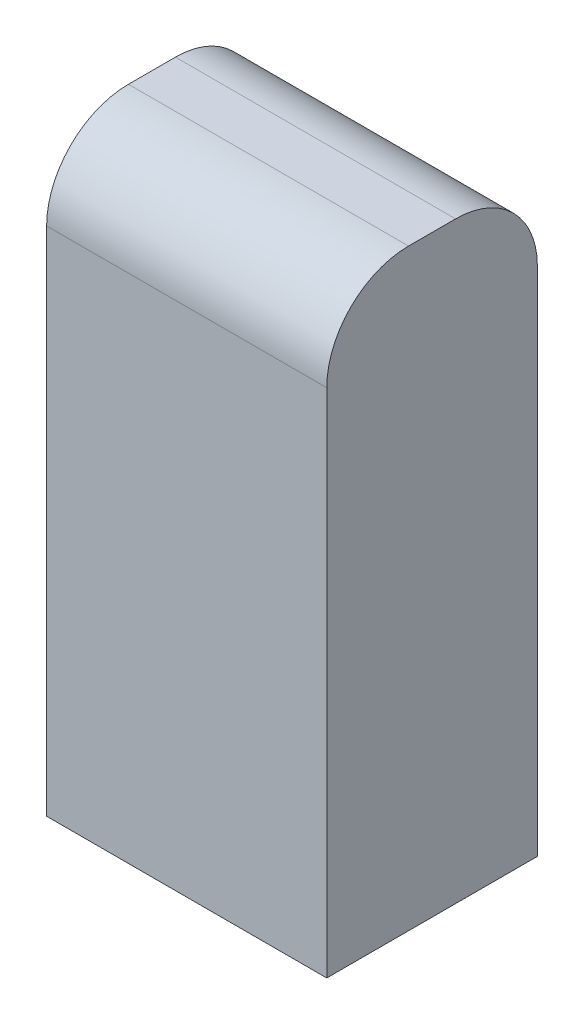
ISO-10303-21;
HEADER;
FILE_DESCRIPTION(('STEP AP214'),'2;1');
FILE_NAME('part.step','',(''),(''),'','','');
FILE_SCHEMA(('AUTOMOTIVE_DESIGN { 1 0 10303 214 1 1 1 1 }'));
ENDSEC;
DATA;
#1=APPLICATION_CONTEXT('core data for automotive mechanical design processes');
#2=APPLICATION_PROTOCOL_DEFINITION('international standard','automotive_design',2000,#1);
#3=PRODUCT_CONTEXT('',#1,'mechanical');
#4=PRODUCT('Part','Part','',(#3));
#5=PRODUCT_RELATED_PRODUCT_CATEGORY('part','',(#4));
#6=PRODUCT_DEFINITION_FORMATION('','',#4);
#7=PRODUCT_DEFINITION_CONTEXT('part definition',#1,'design');
#8=PRODUCT_DEFINITION('design','',#6,#7);
#9=PRODUCT_DEFINITION_SHAPE('','',#8);
#10=(LENGTH_UNIT() NAMED_UNIT(*) SI_UNIT(.MILLI.,.METRE.));
#11=(NAMED_UNIT(*) PLANE_ANGLE_UNIT() SI_UNIT($,.RADIAN.));
#12=(NAMED_UNIT(*) SI_UNIT($,.STERADIAN.) SOLID_ANGLE_UNIT());
#13=UNCERTAINTY_MEASURE_WITH_UNIT(LENGTH_MEASURE(1.E-05),#10,'distance_accuracy_value','');
#14=(GEOMETRIC_REPRESENTATION_CONTEXT(3) GLOBAL_UNCERTAINTY_ASSIGNED_CONTEXT((#13)) GLOBAL_UNIT_ASSIGNED_CONTEXT((#10,
#11,#12)) REPRESENTATION_CONTEXT('',''));
#15=CARTESIAN_POINT('',(0.,0.,0.));
#16=DIRECTION('',(0.,0.,1.));
#17=DIRECTION('',(1.,0.,0.));
#18=AXIS2_PLACEMENT_3D('',#15,#16,#17);
#19=CARTESIAN_POINT('',(17.399,73.66,13.081));
#20=DIRECTION('',(-1.,0.,0.));
#21=DIRECTION('',(0.,0.,1.));
#22=AXIS2_PLACEMENT_3D('',#19,#20,#21);
#23=PLANE('',#22);
#24=DIRECTION('',(0.,-1.,0.));
#25=VECTOR('',#24,1.);
#26=CARTESIAN_POINT('',(17.399,73.66,-13.081));
#27=LINE('',#26,#25);
#28=CARTESIAN_POINT('',(17.399,63.5,-13.081));
#29=VERTEX_POINT('',#28);
#30=CARTESIAN_POINT('',(17.399,0.,-13.081));
#31=VERTEX_POINT('',#30);
#32=EDGE_CURVE('E87',#29,#31,#27,.T.);
#33=ORIENTED_EDGE('',*,*,#32,.F.);
#34=CARTESIAN_POINT('',(17.399,63.5,-2.921));
#35=DIRECTION('',(-1.,0.,0.));
#36=DIRECTION('',(0.,0.,1.));
#37=AXIS2_PLACEMENT_3D('',#34,#35,#36);
#38=CIRCLE('',#37,10.16);
#39=CARTESIAN_POINT('',(17.399,73.66,-2.921));
#40=VERTEX_POINT('',#39);
#41=EDGE_CURVE('E44',#29,#40,#38,.F.);
#42=ORIENTED_EDGE('',*,*,#41,.T.);
#43=DIRECTION('',(0.,0.,-1.));
#44=VECTOR('',#43,1.);
#45=CARTESIAN_POINT('',(17.399,73.66,13.081));
#46=LINE('',#45,#44);
#47=CARTESIAN_POINT('',(17.399,73.66,2.921));
#48=VERTEX_POINT('',#47);
#49=EDGE_CURVE('E115',#48,#40,#46,.T.);
#50=ORIENTED_EDGE('',*,*,#49,.F.);
#51=CARTESIAN_POINT('',(17.399,63.5,2.921));
#52=DIRECTION('',(-1.,0.,0.));
#53=DIRECTION('',(0.,0.,1.));
#54=AXIS2_PLACEMENT_3D('',#51,#52,#53);
#55=CIRCLE('',#54,10.16);
#56=CARTESIAN_POINT('',(17.399,63.5,13.081));
#57=VERTEX_POINT('',#56);
#58=EDGE_CURVE('E51',#48,#57,#55,.F.);
#59=ORIENTED_EDGE('',*,*,#58,.T.);
#60=DIRECTION('',(0.,-1.,0.));
#61=VECTOR('',#60,1.);
#62=CARTESIAN_POINT('',(17.399,73.66,13.081));
#63=LINE('',#62,#61);
#64=CARTESIAN_POINT('',(17.399,0.,13.081));
#65=VERTEX_POINT('',#64);
#66=EDGE_CURVE('E105',#57,#65,#63,.T.);
#67=ORIENTED_EDGE('',*,*,#66,.T.);
#68=DIRECTION('',(0.,0.,-1.));
#69=VECTOR('',#68,1.);
#70=CARTESIAN_POINT('',(17.399,0.,13.081));
#71=LINE('',#70,#69);
#72=EDGE_CURVE('E101',#65,#31,#71,.T.);
#73=ORIENTED_EDGE('',*,*,#72,.T.);
#74=EDGE_LOOP('',(#33,#42,#50,#59,#67,#73));
#75=FACE_BOUND('',#74,.T.);
#76=ADVANCED_FACE('F36',(#75),#23,.F.);
#77=CARTESIAN_POINT('',(-17.399,73.66,-13.081));
#78=DIRECTION('',(0.,0.,1.));
#79=DIRECTION('',(1.,0.,0.));
#80=AXIS2_PLACEMENT_3D('',#77,#78,#79);
#81=PLANE('',#80);
#82=DIRECTION('',(0.,-1.,0.));
#83=VECTOR('',#82,1.);
#84=CARTESIAN_POINT('',(-17.399,73.66,-13.081));
#85=LINE('',#84,#83);
#86=CARTESIAN_POINT('',(-17.399,63.5,-13.081));
#87=VERTEX_POINT('',#86);
#88=CARTESIAN_POINT('',(-17.399,0.,-13.081));
#89=VERTEX_POINT('',#88);
#90=EDGE_CURVE('E95',#87,#89,#85,.T.);
#91=ORIENTED_EDGE('',*,*,#90,.F.);
#92=DIRECTION('',(-1.,0.,0.));
#93=VECTOR('',#92,1.);
#94=CARTESIAN_POINT('',(-17.399,63.5,-13.081));
#95=LINE('',#94,#93);
#96=EDGE_CURVE('E59',#87,#29,#95,.F.);
#97=ORIENTED_EDGE('',*,*,#96,.T.);
#98=ORIENTED_EDGE('',*,*,#32,.T.);
#99=DIRECTION('',(-1.,0.,0.));
#100=VECTOR('',#99,1.);
#101=CARTESIAN_POINT('',(-17.399,0.,-13.081));
#102=LINE('',#101,#100);
#103=EDGE_CURVE('E90',#31,#89,#102,.T.);
#104=ORIENTED_EDGE('',*,*,#103,.T.);
#105=EDGE_LOOP('',(#91,#97,#98,#104));
#106=FACE_BOUND('',#105,.T.);
#107=ADVANCED_FACE('F89',(#106),#81,.F.);
#108=CARTESIAN_POINT('',(-17.399,73.66,13.081));
#109=DIRECTION('',(1.,0.,0.));
#110=DIRECTION('',(0.,0.,-1.));
#111=AXIS2_PLACEMENT_3D('',#108,#109,#110);
#112=PLANE('',#111);
#113=DIRECTION('',(0.,0.,1.));
#114=VECTOR('',#113,1.);
#115=CARTESIAN_POINT('',(-17.399,73.66,13.081));
#116=LINE('',#115,#114);
#117=CARTESIAN_POINT('',(-17.399,73.66,-2.921));
#118=VERTEX_POINT('',#117);
#119=CARTESIAN_POINT('',(-17.399,73.66,2.921));
#120=VERTEX_POINT('',#119);
#121=EDGE_CURVE('E109',#118,#120,#116,.T.);
#122=ORIENTED_EDGE('',*,*,#121,.F.);
#123=CARTESIAN_POINT('',(-17.399,63.5,-2.921));
#124=DIRECTION('',(1.,0.,0.));
#125=DIRECTION('',(0.,0.,-1.));
#126=AXIS2_PLACEMENT_3D('',#123,#124,#125);
#127=CIRCLE('',#126,10.16);
#128=EDGE_CURVE('E127',#118,#87,#127,.F.);
#129=ORIENTED_EDGE('',*,*,#128,.T.);
#130=ORIENTED_EDGE('',*,*,#90,.T.);
#131=DIRECTION('',(0.,0.,1.));
#132=VECTOR('',#131,1.);
#133=CARTESIAN_POINT('',(-17.399,0.,13.081));
#134=LINE('',#133,#132);
#135=CARTESIAN_POINT('',(-17.399,0.,13.081));
#136=VERTEX_POINT('',#135);
#137=EDGE_CURVE('E103',#89,#136,#134,.T.);
#138=ORIENTED_EDGE('',*,*,#137,.T.);
#139=DIRECTION('',(0.,-1.,0.));
#140=VECTOR('',#139,1.);
#141=CARTESIAN_POINT('',(-17.399,73.66,13.081));
#142=LINE('',#141,#140);
#143=CARTESIAN_POINT('',(-17.399,63.5,13.081));
#144=VERTEX_POINT('',#143);
#145=EDGE_CURVE('E117',#144,#136,#142,.T.);
#146=ORIENTED_EDGE('',*,*,#145,.F.);
#147=CARTESIAN_POINT('',(-17.399,63.5,2.921));
#148=DIRECTION('',(1.,0.,0.));
#149=DIRECTION('',(0.,0.,-1.));
#150=AXIS2_PLACEMENT_3D('',#147,#148,#149);
#151=CIRCLE('',#150,10.16);
#152=EDGE_CURVE('E125',#144,#120,#151,.F.);
#153=ORIENTED_EDGE('',*,*,#152,.T.);
#154=EDGE_LOOP('',(#122,#129,#130,#138,#146,#153));
#155=FACE_BOUND('',#154,.T.);
#156=ADVANCED_FACE('F140',(#155),#112,.F.);
#157=CARTESIAN_POINT('',(-17.399,73.66,13.081));
#158=DIRECTION('',(0.,0.,-1.));
#159=DIRECTION('',(-1.,0.,0.));
#160=AXIS2_PLACEMENT_3D('',#157,#158,#159);
#161=PLANE('',#160);
#162=ORIENTED_EDGE('',*,*,#66,.F.);
#163=DIRECTION('',(1.,0.,0.));
#164=VECTOR('',#163,1.);
#165=CARTESIAN_POINT('',(-17.399,63.5,13.081));
#166=LINE('',#165,#164);
#167=EDGE_CURVE('E11',#57,#144,#166,.F.);
#168=ORIENTED_EDGE('',*,*,#167,.T.);
#169=ORIENTED_EDGE('',*,*,#145,.T.);
#170=DIRECTION('',(1.,0.,0.));
#171=VECTOR('',#170,1.);
#172=CARTESIAN_POINT('',(-17.399,0.,13.081));
#173=LINE('',#172,#171);
#174=EDGE_CURVE('E113',#136,#65,#173,.T.);
#175=ORIENTED_EDGE('',*,*,#174,.T.);
#176=EDGE_LOOP('',(#162,#168,#169,#175));
#177=FACE_BOUND('',#176,.T.);
#178=ADVANCED_FACE('F146',(#177),#161,.F.);
#179=CARTESIAN_POINT('',(0.,73.66,0.));
#180=DIRECTION('',(0.,-1.,0.));
#181=DIRECTION('',(0.,0.,-1.));
#182=AXIS2_PLACEMENT_3D('',#179,#180,#181);
#183=PLANE('',#182);
#184=ORIENTED_EDGE('',*,*,#49,.T.);
#185=DIRECTION('',(-1.,0.,0.));
#186=VECTOR('',#185,1.);
#187=CARTESIAN_POINT('',(0.,73.66,-2.921));
#188=LINE('',#187,#186);
#189=EDGE_CURVE('E122',#40,#118,#188,.T.);
#190=ORIENTED_EDGE('',*,*,#189,.T.);
#191=ORIENTED_EDGE('',*,*,#121,.T.);
#192=DIRECTION('',(1.,0.,0.));
#193=VECTOR('',#192,1.);
#194=CARTESIAN_POINT('',(0.,73.66,2.921));
#195=LINE('',#194,#193);
#196=EDGE_CURVE('E94',#120,#48,#195,.T.);
#197=ORIENTED_EDGE('',*,*,#196,.T.);
#198=EDGE_LOOP('',(#184,#190,#191,#197));
#199=FACE_BOUND('',#198,.T.);
#200=ADVANCED_FACE('F134',(#199),#183,.F.);
#201=CARTESIAN_POINT('',(0.,0.,0.));
#202=DIRECTION('',(0.,-1.,0.));
#203=DIRECTION('',(0.,0.,-1.));
#204=AXIS2_PLACEMENT_3D('',#201,#202,#203);
#205=PLANE('',#204);
#206=ORIENTED_EDGE('',*,*,#72,.F.);
#207=ORIENTED_EDGE('',*,*,#174,.F.);
#208=ORIENTED_EDGE('',*,*,#137,.F.);
#209=ORIENTED_EDGE('',*,*,#103,.F.);
#210=EDGE_LOOP('',(#206,#207,#208,#209));
#211=FACE_BOUND('',#210,.T.);
#212=ADVANCED_FACE('F99',(#211),#205,.T.);
#213=CARTESIAN_POINT('',(0.,63.5,-2.921));
#214=DIRECTION('',(-1.,0.,0.));
#215=DIRECTION('',(0.,0.,1.));
#216=AXIS2_PLACEMENT_3D('',#213,#214,#215);
#217=CYLINDRICAL_SURFACE('',#216,10.16);
#218=ORIENTED_EDGE('',*,*,#41,.F.);
#219=ORIENTED_EDGE('',*,*,#96,.F.);
#220=ORIENTED_EDGE('',*,*,#128,.F.);
#221=ORIENTED_EDGE('',*,*,#189,.F.);
#222=EDGE_LOOP('',(#218,#219,#220,#221));
#223=FACE_BOUND('',#222,.T.);
#224=ADVANCED_FACE('F138',(#223),#217,.T.);
#225=CARTESIAN_POINT('',(0.,63.5,2.921));
#226=DIRECTION('',(1.,0.,0.));
#227=DIRECTION('',(0.,0.,-1.));
#228=AXIS2_PLACEMENT_3D('',#225,#226,#227);
#229=CYLINDRICAL_SURFACE('',#228,10.16);
#230=ORIENTED_EDGE('',*,*,#152,.F.);
#231=ORIENTED_EDGE('',*,*,#167,.F.);
#232=ORIENTED_EDGE('',*,*,#58,.F.);
#233=ORIENTED_EDGE('',*,*,#196,.F.);
#234=EDGE_LOOP('',(#230,#231,#232,#233));
#235=FACE_BOUND('',#234,.T.);
#236=ADVANCED_FACE('F38',(#235),#229,.T.);
#237=CLOSED_SHELL('',(#76,#107,#156,#178,#200,#212,#224,#236));
#238=MANIFOLD_SOLID_BREP('B2',#237);
#239=ADVANCED_BREP_SHAPE_REPRESENTATION('',(#18,#238),#14);
#240=SHAPE_DEFINITION_REPRESENTATION(#9,#239);
ENDSEC;
END-ISO-10303-21;
